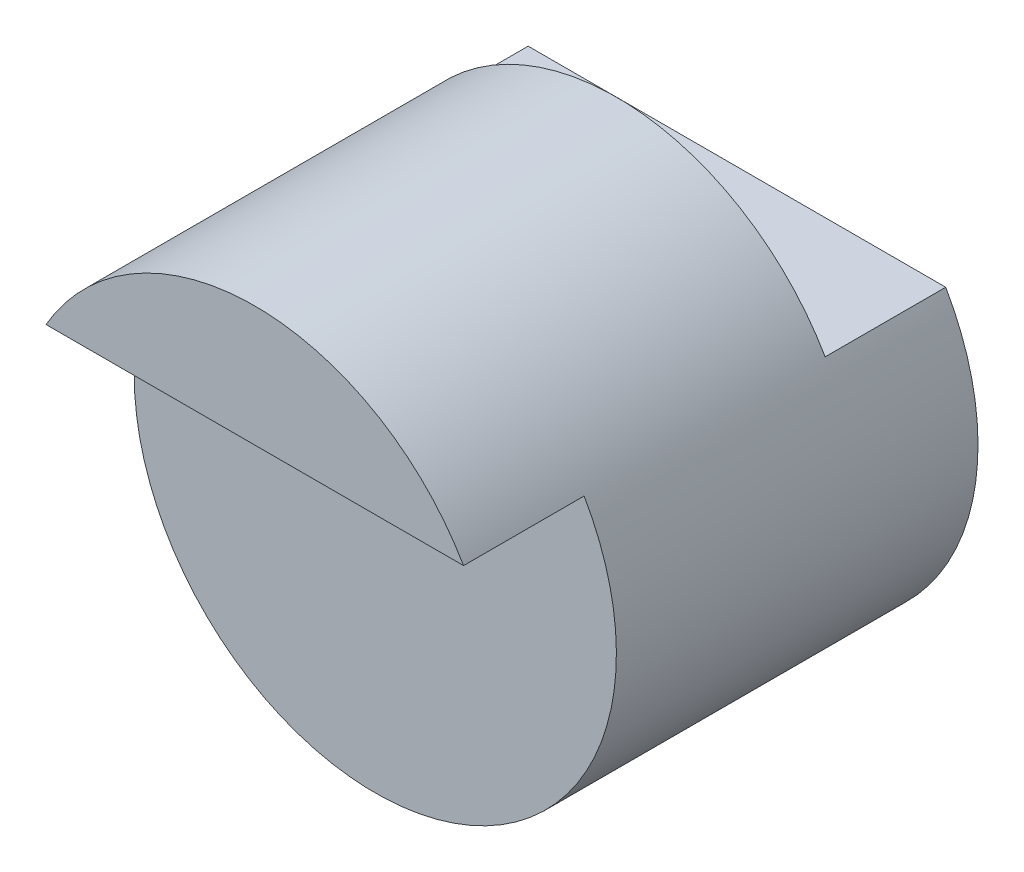
ISO-10303-21;
HEADER;
FILE_DESCRIPTION(('STEP AP214'),'2;1');
FILE_NAME('part.step','',(''),(''),'','','');
FILE_SCHEMA(('AUTOMOTIVE_DESIGN { 1 0 10303 214 1 1 1 1 }'));
ENDSEC;
DATA;
#1=APPLICATION_CONTEXT('core data for automotive mechanical design processes');
#2=APPLICATION_PROTOCOL_DEFINITION('international standard','automotive_design',2000,#1);
#3=PRODUCT_CONTEXT('',#1,'mechanical');
#4=PRODUCT('Part','Part','',(#3));
#5=PRODUCT_RELATED_PRODUCT_CATEGORY('part','',(#4));
#6=PRODUCT_DEFINITION_FORMATION('','',#4);
#7=PRODUCT_DEFINITION_CONTEXT('part definition',#1,'design');
#8=PRODUCT_DEFINITION('design','',#6,#7);
#9=PRODUCT_DEFINITION_SHAPE('','',#8);
#10=(LENGTH_UNIT() NAMED_UNIT(*) SI_UNIT(.MILLI.,.METRE.));
#11=(NAMED_UNIT(*) PLANE_ANGLE_UNIT() SI_UNIT($,.RADIAN.));
#12=(NAMED_UNIT(*) SI_UNIT($,.STERADIAN.) SOLID_ANGLE_UNIT());
#13=UNCERTAINTY_MEASURE_WITH_UNIT(LENGTH_MEASURE(1.E-05),#10,'distance_accuracy_value','');
#14=(GEOMETRIC_REPRESENTATION_CONTEXT(3) GLOBAL_UNCERTAINTY_ASSIGNED_CONTEXT((#13)) GLOBAL_UNIT_ASSIGNED_CONTEXT((#10,
#11,#12)) REPRESENTATION_CONTEXT('',''));
#15=CARTESIAN_POINT('',(0.,0.,0.));
#16=DIRECTION('',(0.,0.,1.));
#17=DIRECTION('',(1.,0.,0.));
#18=AXIS2_PLACEMENT_3D('',#15,#16,#17);
#19=CARTESIAN_POINT('',(0.,0.,3.));
#20=DIRECTION('',(0.,0.,-1.));
#21=DIRECTION('',(-1.,0.,0.));
#22=AXIS2_PLACEMENT_3D('',#19,#20,#21);
#23=CYLINDRICAL_SURFACE('',#22,2.);
#24=CARTESIAN_POINT('',(0.,0.,3.));
#25=DIRECTION('',(0.,0.,1.));
#26=DIRECTION('',(1.,0.,0.));
#27=AXIS2_PLACEMENT_3D('',#24,#25,#26);
#28=CIRCLE('',#27,2.);
#29=CARTESIAN_POINT('',(-1.73205080756888,1.,3.));
#30=VERTEX_POINT('',#29);
#31=CARTESIAN_POINT('',(1.73205080756888,1.,3.));
#32=VERTEX_POINT('',#31);
#33=EDGE_CURVE('E11',#30,#32,#28,.T.);
#34=ORIENTED_EDGE('',*,*,#33,.F.);
#35=DIRECTION('',(0.,0.,-1.));
#36=VECTOR('',#35,1.);
#37=CARTESIAN_POINT('',(-1.73205080756888,1.,4.));
#38=LINE('',#37,#36);
#39=CARTESIAN_POINT('',(-1.73205080756888,1.,4.));
#40=VERTEX_POINT('',#39);
#41=EDGE_CURVE('E98',#40,#30,#38,.T.);
#42=ORIENTED_EDGE('',*,*,#41,.F.);
#43=CARTESIAN_POINT('',(0.,0.,4.));
#44=DIRECTION('',(0.,0.,1.));
#45=DIRECTION('',(-1.,0.,0.));
#46=AXIS2_PLACEMENT_3D('',#43,#44,#45);
#47=CIRCLE('',#46,2.);
#48=CARTESIAN_POINT('',(1.73205080756888,1.,4.));
#49=VERTEX_POINT('',#48);
#50=EDGE_CURVE('E89',#49,#40,#47,.T.);
#51=ORIENTED_EDGE('',*,*,#50,.F.);
#52=DIRECTION('',(0.,0.,-1.));
#53=VECTOR('',#52,1.);
#54=CARTESIAN_POINT('',(1.73205080756888,1.,4.));
#55=LINE('',#54,#53);
#56=EDGE_CURVE('E94',#49,#32,#55,.T.);
#57=ORIENTED_EDGE('',*,*,#56,.T.);
#58=EDGE_LOOP('',(#34,#42,#51,#57));
#59=FACE_BOUND('',#58,.T.);
#60=CARTESIAN_POINT('',(0.,0.,1.));
#61=DIRECTION('',(0.,0.,-1.));
#62=DIRECTION('',(-1.,0.,0.));
#63=AXIS2_PLACEMENT_3D('',#60,#61,#62);
#64=CIRCLE('',#63,2.);
#65=CARTESIAN_POINT('',(-1.73205080756888,1.,1.));
#66=VERTEX_POINT('',#65);
#67=CARTESIAN_POINT('',(1.73205080756888,1.,1.));
#68=VERTEX_POINT('',#67);
#69=EDGE_CURVE('E73',#66,#68,#64,.T.);
#70=ORIENTED_EDGE('',*,*,#69,.F.);
#71=DIRECTION('',(0.,0.,-1.));
#72=VECTOR('',#71,1.);
#73=CARTESIAN_POINT('',(-1.73205080756888,1.,1.));
#74=LINE('',#73,#72);
#75=CARTESIAN_POINT('',(-1.73205080756888,1.,0.));
#76=VERTEX_POINT('',#75);
#77=EDGE_CURVE('E81',#66,#76,#74,.T.);
#78=ORIENTED_EDGE('',*,*,#77,.T.);
#79=CARTESIAN_POINT('',(0.,0.,0.));
#80=DIRECTION('',(0.,0.,1.));
#81=DIRECTION('',(1.,0.,0.));
#82=AXIS2_PLACEMENT_3D('',#79,#80,#81);
#83=CIRCLE('',#82,2.);
#84=CARTESIAN_POINT('',(1.73205080756888,1.,0.));
#85=VERTEX_POINT('',#84);
#86=EDGE_CURVE('E36',#76,#85,#83,.T.);
#87=ORIENTED_EDGE('',*,*,#86,.T.);
#88=DIRECTION('',(0.,0.,-1.));
#89=VECTOR('',#88,1.);
#90=CARTESIAN_POINT('',(1.73205080756888,1.,1.));
#91=LINE('',#90,#89);
#92=EDGE_CURVE('E47',#68,#85,#91,.T.);
#93=ORIENTED_EDGE('',*,*,#92,.F.);
#94=EDGE_LOOP('',(#70,#78,#87,#93));
#95=FACE_BOUND('',#94,.T.);
#96=ADVANCED_FACE('F33',(#59,#95),#23,.T.);
#97=CARTESIAN_POINT('',(0.,0.,3.));
#98=DIRECTION('',(0.,0.,1.));
#99=DIRECTION('',(1.,0.,0.));
#100=AXIS2_PLACEMENT_3D('',#97,#98,#99);
#101=PLANE('',#100);
#102=DIRECTION('',(1.,0.,0.));
#103=VECTOR('',#102,1.);
#104=CARTESIAN_POINT('',(-1.73205080756888,1.,3.));
#105=LINE('',#104,#103);
#106=EDGE_CURVE('E53',#30,#32,#105,.T.);
#107=ORIENTED_EDGE('',*,*,#106,.F.);
#108=ORIENTED_EDGE('',*,*,#33,.T.);
#109=EDGE_LOOP('',(#107,#108));
#110=FACE_BOUND('',#109,.T.);
#111=ADVANCED_FACE('F106',(#110),#101,.T.);
#112=CARTESIAN_POINT('',(0.,0.,0.));
#113=DIRECTION('',(0.,0.,1.));
#114=DIRECTION('',(1.,0.,0.));
#115=AXIS2_PLACEMENT_3D('',#112,#113,#114);
#116=PLANE('',#115);
#117=ORIENTED_EDGE('',*,*,#86,.F.);
#118=DIRECTION('',(-1.,0.,0.));
#119=VECTOR('',#118,1.);
#120=CARTESIAN_POINT('',(-1.73205080756888,1.,0.));
#121=LINE('',#120,#119);
#122=EDGE_CURVE('E78',#85,#76,#121,.T.);
#123=ORIENTED_EDGE('',*,*,#122,.F.);
#124=EDGE_LOOP('',(#117,#123));
#125=FACE_BOUND('',#124,.T.);
#126=ADVANCED_FACE('F108',(#125),#116,.F.);
#127=CARTESIAN_POINT('',(-1.73205080756888,1.,4.));
#128=DIRECTION('',(0.,1.,0.));
#129=DIRECTION('',(0.,0.,1.));
#130=AXIS2_PLACEMENT_3D('',#127,#128,#129);
#131=PLANE('',#130);
#132=ORIENTED_EDGE('',*,*,#106,.T.);
#133=ORIENTED_EDGE('',*,*,#56,.F.);
#134=DIRECTION('',(1.,0.,0.));
#135=VECTOR('',#134,1.);
#136=CARTESIAN_POINT('',(-1.73205080756888,1.,4.));
#137=LINE('',#136,#135);
#138=EDGE_CURVE('E92',#40,#49,#137,.T.);
#139=ORIENTED_EDGE('',*,*,#138,.F.);
#140=ORIENTED_EDGE('',*,*,#41,.T.);
#141=EDGE_LOOP('',(#132,#133,#139,#140));
#142=FACE_BOUND('',#141,.T.);
#143=ADVANCED_FACE('F102',(#142),#131,.F.);
#144=CARTESIAN_POINT('',(0.,0.,4.));
#145=DIRECTION('',(0.,0.,-1.));
#146=DIRECTION('',(-1.,0.,0.));
#147=AXIS2_PLACEMENT_3D('',#144,#145,#146);
#148=PLANE('',#147);
#149=ORIENTED_EDGE('',*,*,#50,.T.);
#150=ORIENTED_EDGE('',*,*,#138,.T.);
#151=EDGE_LOOP('',(#149,#150));
#152=FACE_BOUND('',#151,.T.);
#153=ADVANCED_FACE('F118',(#152),#148,.F.);
#154=CARTESIAN_POINT('',(-1.73205080756888,1.,1.));
#155=DIRECTION('',(0.,-1.,0.));
#156=DIRECTION('',(1.,0.,0.));
#157=AXIS2_PLACEMENT_3D('',#154,#155,#156);
#158=PLANE('',#157);
#159=ORIENTED_EDGE('',*,*,#122,.T.);
#160=ORIENTED_EDGE('',*,*,#77,.F.);
#161=DIRECTION('',(-1.,0.,0.));
#162=VECTOR('',#161,1.);
#163=CARTESIAN_POINT('',(-1.73205080756888,1.,1.));
#164=LINE('',#163,#162);
#165=EDGE_CURVE('E75',#68,#66,#164,.T.);
#166=ORIENTED_EDGE('',*,*,#165,.F.);
#167=ORIENTED_EDGE('',*,*,#92,.T.);
#168=EDGE_LOOP('',(#159,#160,#166,#167));
#169=FACE_BOUND('',#168,.T.);
#170=ADVANCED_FACE('F80',(#169),#158,.F.);
#171=CARTESIAN_POINT('',(0.,0.,1.));
#172=DIRECTION('',(0.,0.,-1.));
#173=DIRECTION('',(-1.,0.,0.));
#174=AXIS2_PLACEMENT_3D('',#171,#172,#173);
#175=PLANE('',#174);
#176=ORIENTED_EDGE('',*,*,#69,.T.);
#177=ORIENTED_EDGE('',*,*,#165,.T.);
#178=EDGE_LOOP('',(#176,#177));
#179=FACE_BOUND('',#178,.T.);
#180=ADVANCED_FACE('F74',(#179),#175,.T.);
#181=CLOSED_SHELL('',(#96,#111,#126,#143,#153,#170,#180));
#182=MANIFOLD_SOLID_BREP('B2',#181);
#183=ADVANCED_BREP_SHAPE_REPRESENTATION('',(#18,#182),#14);
#184=SHAPE_DEFINITION_REPRESENTATION(#9,#183);
ENDSEC;
END-ISO-10303-21;
